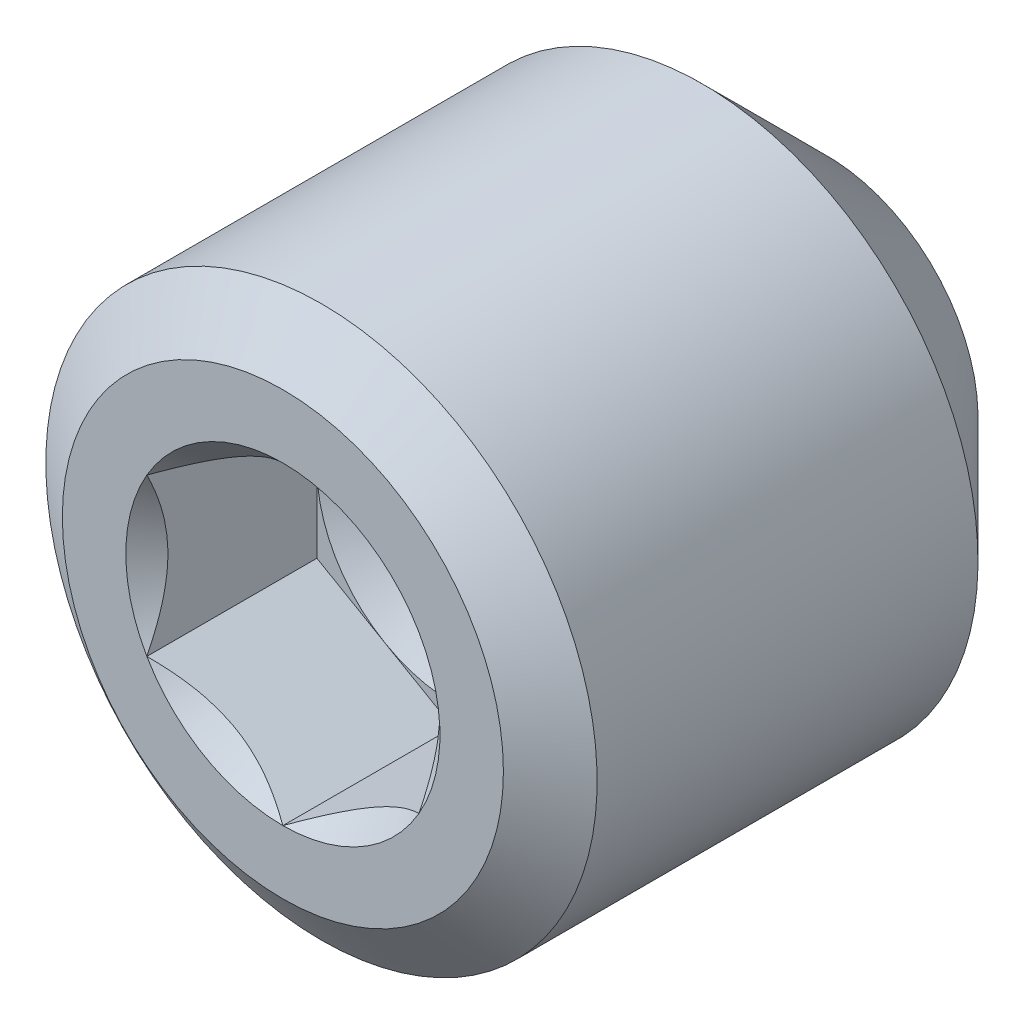
ISO-10303-21;
HEADER;
FILE_DESCRIPTION(('STEP AP214'),'2;1');
FILE_NAME('part.step','',(''),(''),'','','');
FILE_SCHEMA(('AUTOMOTIVE_DESIGN { 1 0 10303 214 1 1 1 1 }'));
ENDSEC;
DATA;
#1=APPLICATION_CONTEXT('core data for automotive mechanical design processes');
#2=APPLICATION_PROTOCOL_DEFINITION('international standard','automotive_design',2000,#1);
#3=PRODUCT_CONTEXT('',#1,'mechanical');
#4=PRODUCT('Part','Part','',(#3));
#5=PRODUCT_RELATED_PRODUCT_CATEGORY('part','',(#4));
#6=PRODUCT_DEFINITION_FORMATION('','',#4);
#7=PRODUCT_DEFINITION_CONTEXT('part definition',#1,'design');
#8=PRODUCT_DEFINITION('design','',#6,#7);
#9=PRODUCT_DEFINITION_SHAPE('','',#8);
#10=(LENGTH_UNIT() NAMED_UNIT(*) SI_UNIT(.MILLI.,.METRE.));
#11=(NAMED_UNIT(*) PLANE_ANGLE_UNIT() SI_UNIT($,.RADIAN.));
#12=(NAMED_UNIT(*) SI_UNIT($,.STERADIAN.) SOLID_ANGLE_UNIT());
#13=UNCERTAINTY_MEASURE_WITH_UNIT(LENGTH_MEASURE(1.E-05),#10,'distance_accuracy_value','');
#14=(GEOMETRIC_REPRESENTATION_CONTEXT(3) GLOBAL_UNCERTAINTY_ASSIGNED_CONTEXT((#13)) GLOBAL_UNIT_ASSIGNED_CONTEXT((#10,
#11,#12)) REPRESENTATION_CONTEXT('',''));
#15=CARTESIAN_POINT('',(0.,0.,0.));
#16=DIRECTION('',(0.,0.,1.));
#17=DIRECTION('',(1.,0.,0.));
#18=AXIS2_PLACEMENT_3D('',#15,#16,#17);
#19=CARTESIAN_POINT('',(0.,0.,0.495727982126937));
#20=DIRECTION('',(0.,0.,1.));
#21=DIRECTION('',(0.,-1.,0.));
#22=AXIS2_PLACEMENT_3D('',#19,#20,#21);
#23=CONICAL_SURFACE('',#22,1.19062499987876,1.04719755103086);
#24=CARTESIAN_POINT('',(2.55795384873636E-10,0.,-0.19167968210354));
#25=VERTEX_POINT('',#24);
#26=VERTEX_LOOP('',#25);
#27=FACE_BOUND('',#26,.T.);
#28=CARTESIAN_POINT('',(0.,0.,0.495727982192574));
#29=DIRECTION('',(0.,0.,1.));
#30=DIRECTION('',(0.,-1.,0.));
#31=AXIS2_PLACEMENT_3D('',#28,#29,#30);
#32=CIRCLE('',#31,1.19062499999245);
#33=CARTESIAN_POINT('',(1.19062499999623,0.,0.495727982183542));
#34=VERTEX_POINT('',#33);
#35=CARTESIAN_POINT('',(0.595312499998112,-1.03111149637757,0.495727982183542));
#36=VERTEX_POINT('',#35);
#37=EDGE_CURVE('E101',#34,#36,#32,.F.);
#38=ORIENTED_EDGE('',*,*,#37,.F.);
#39=CARTESIAN_POINT('',(0.,0.,0.495727982192574));
#40=DIRECTION('',(0.,0.,1.));
#41=DIRECTION('',(0.,-1.,0.));
#42=AXIS2_PLACEMENT_3D('',#39,#40,#41);
#43=CIRCLE('',#42,1.19062499999245);
#44=CARTESIAN_POINT('',(0.59531249999812,1.03111149637759,0.495727982183542));
#45=VERTEX_POINT('',#44);
#46=EDGE_CURVE('E115',#45,#34,#43,.F.);
#47=ORIENTED_EDGE('',*,*,#46,.F.);
#48=CARTESIAN_POINT('',(0.,0.,0.495727982192574));
#49=DIRECTION('',(0.,0.,1.));
#50=DIRECTION('',(0.,-1.,0.));
#51=AXIS2_PLACEMENT_3D('',#48,#49,#50);
#52=CIRCLE('',#51,1.19062499999245);
#53=CARTESIAN_POINT('',(-0.595312499998102,1.0311114963776,0.495727982183538));
#54=VERTEX_POINT('',#53);
#55=EDGE_CURVE('E253',#54,#45,#52,.F.);
#56=ORIENTED_EDGE('',*,*,#55,.F.);
#57=CARTESIAN_POINT('',(0.,0.,0.495727982192574));
#58=DIRECTION('',(0.,0.,1.));
#59=DIRECTION('',(0.,-1.,0.));
#60=AXIS2_PLACEMENT_3D('',#57,#58,#59);
#61=CIRCLE('',#60,1.19062499999245);
#62=CARTESIAN_POINT('',(-1.19062499999622,1.30013777685213E-13,0.495727982183538));
#63=VERTEX_POINT('',#62);
#64=EDGE_CURVE('E152',#63,#54,#61,.F.);
#65=ORIENTED_EDGE('',*,*,#64,.F.);
#66=CARTESIAN_POINT('',(0.,0.,0.495727982192574));
#67=DIRECTION('',(0.,0.,1.));
#68=DIRECTION('',(0.,-1.,0.));
#69=AXIS2_PLACEMENT_3D('',#66,#67,#68);
#70=CIRCLE('',#69,1.19062499999245);
#71=CARTESIAN_POINT('',(-0.595312499998087,-1.03111149637758,0.495727982183542));
#72=VERTEX_POINT('',#71);
#73=EDGE_CURVE('E20',#72,#63,#70,.F.);
#74=ORIENTED_EDGE('',*,*,#73,.F.);
#75=CARTESIAN_POINT('',(0.,0.,0.495727982192574));
#76=DIRECTION('',(0.,0.,1.));
#77=DIRECTION('',(0.,-1.,0.));
#78=AXIS2_PLACEMENT_3D('',#75,#76,#77);
#79=CIRCLE('',#78,1.19062499999245);
#80=EDGE_CURVE('E373',#36,#72,#79,.F.);
#81=ORIENTED_EDGE('',*,*,#80,.F.);
#82=EDGE_LOOP('',(#38,#47,#56,#65,#74,#81));
#83=FACE_BOUND('',#82,.T.);
#84=ADVANCED_FACE('F17',(#27,#83),#23,.F.);
#85=CARTESIAN_POINT('',(-1.190625,2.06222299276171,0.49572798217451));
#86=DIRECTION('',(0.,0.,1.));
#87=DIRECTION('',(0.,-1.,0.));
#88=AXIS2_PLACEMENT_3D('',#85,#86,#87);
#89=PLANE('',#88);
#90=DIRECTION('',(0.,-1.,0.));
#91=VECTOR('',#90,1.);
#92=CARTESIAN_POINT('',(-1.190625,0.687407664253913,0.49572798217451));
#93=LINE('',#92,#91);
#94=CARTESIAN_POINT('',(-1.19062500000001,-0.687407664253882,0.49572798217451));
#95=VERTEX_POINT('',#94);
#96=EDGE_CURVE('E84',#63,#95,#93,.T.);
#97=ORIENTED_EDGE('',*,*,#96,.T.);
#98=DIRECTION('',(0.866025403784438,-0.500000000000001,0.));
#99=VECTOR('',#98,1.);
#100=CARTESIAN_POINT('',(-1.190625,-0.687407664253889,0.49572798217451));
#101=LINE('',#100,#99);
#102=EDGE_CURVE('E168',#95,#72,#101,.T.);
#103=ORIENTED_EDGE('',*,*,#102,.T.);
#104=ORIENTED_EDGE('',*,*,#73,.T.);
#105=EDGE_LOOP('',(#97,#103,#104));
#106=FACE_BOUND('',#105,.T.);
#107=ADVANCED_FACE('F270',(#106),#89,.T.);
#108=CARTESIAN_POINT('',(-1.190625,2.06222299276171,0.49572798217451));
#109=DIRECTION('',(0.,0.,1.));
#110=DIRECTION('',(0.,-1.,0.));
#111=AXIS2_PLACEMENT_3D('',#108,#109,#110);
#112=PLANE('',#111);
#113=DIRECTION('',(0.866025403784438,-0.500000000000001,0.));
#114=VECTOR('',#113,1.);
#115=CARTESIAN_POINT('',(-1.190625,-0.687407664253889,0.495727982174503));
#116=LINE('',#115,#114);
#117=CARTESIAN_POINT('',(0.,-1.37481532850779,0.495727982174507));
#118=VERTEX_POINT('',#117);
#119=EDGE_CURVE('E134',#72,#118,#116,.T.);
#120=ORIENTED_EDGE('',*,*,#119,.T.);
#121=DIRECTION('',(0.866025403784439,0.5,0.));
#122=VECTOR('',#121,1.);
#123=CARTESIAN_POINT('',(0.,-1.37481532850779,0.49572798217451));
#124=LINE('',#123,#122);
#125=EDGE_CURVE('E106',#118,#36,#124,.T.);
#126=ORIENTED_EDGE('',*,*,#125,.T.);
#127=ORIENTED_EDGE('',*,*,#80,.T.);
#128=EDGE_LOOP('',(#120,#126,#127));
#129=FACE_BOUND('',#128,.T.);
#130=ADVANCED_FACE('F268',(#129),#112,.T.);
#131=CARTESIAN_POINT('',(-1.190625,2.06222299276171,0.49572798217451));
#132=DIRECTION('',(0.,0.,1.));
#133=DIRECTION('',(0.,-1.,0.));
#134=AXIS2_PLACEMENT_3D('',#131,#132,#133);
#135=PLANE('',#134);
#136=DIRECTION('',(0.866025403784439,0.5,0.));
#137=VECTOR('',#136,1.);
#138=CARTESIAN_POINT('',(0.,-1.37481532850779,0.49572798217451));
#139=LINE('',#138,#137);
#140=CARTESIAN_POINT('',(1.19062500000001,-0.687407664253884,0.49572798217451));
#141=VERTEX_POINT('',#140);
#142=EDGE_CURVE('E96',#36,#141,#139,.T.);
#143=ORIENTED_EDGE('',*,*,#142,.T.);
#144=DIRECTION('',(0.,1.,0.));
#145=VECTOR('',#144,1.);
#146=CARTESIAN_POINT('',(1.19062500000001,-0.687407664253889,0.49572798217451));
#147=LINE('',#146,#145);
#148=EDGE_CURVE('E99',#141,#34,#147,.T.);
#149=ORIENTED_EDGE('',*,*,#148,.T.);
#150=ORIENTED_EDGE('',*,*,#37,.T.);
#151=EDGE_LOOP('',(#143,#149,#150));
#152=FACE_BOUND('',#151,.T.);
#153=ADVANCED_FACE('F98',(#152),#135,.T.);
#154=CARTESIAN_POINT('',(-1.190625,2.06222299276171,0.49572798217451));
#155=DIRECTION('',(0.,0.,1.));
#156=DIRECTION('',(0.,-1.,0.));
#157=AXIS2_PLACEMENT_3D('',#154,#155,#156);
#158=PLANE('',#157);
#159=DIRECTION('',(0.,1.,0.));
#160=VECTOR('',#159,1.);
#161=CARTESIAN_POINT('',(1.19062500000001,-0.687407664253889,0.495727982174509));
#162=LINE('',#161,#160);
#163=CARTESIAN_POINT('',(1.19062500000003,0.687407664253898,0.495727982174509));
#164=VERTEX_POINT('',#163);
#165=EDGE_CURVE('E114',#34,#164,#162,.T.);
#166=ORIENTED_EDGE('',*,*,#165,.T.);
#167=DIRECTION('',(-0.866025403784438,0.5,0.));
#168=VECTOR('',#167,1.);
#169=CARTESIAN_POINT('',(1.19062500000001,0.687407664253913,0.49572798217451));
#170=LINE('',#169,#168);
#171=EDGE_CURVE('E125',#164,#45,#170,.T.);
#172=ORIENTED_EDGE('',*,*,#171,.T.);
#173=ORIENTED_EDGE('',*,*,#46,.T.);
#174=EDGE_LOOP('',(#166,#172,#173));
#175=FACE_BOUND('',#174,.T.);
#176=ADVANCED_FACE('F261',(#175),#158,.T.);
#177=CARTESIAN_POINT('',(1.19062500000001,-0.687407664253889,0.49572798217451));
#178=DIRECTION('',(1.,0.,0.));
#179=DIRECTION('',(0.,1.,0.));
#180=AXIS2_PLACEMENT_3D('',#177,#178,#179);
#181=PLANE('',#180);
#182=CARTESIAN_POINT('',(1.19062499999567,0.687407664292412,1.98400923211493));
#183=CARTESIAN_POINT('',(1.19062499999845,0.64046328207789,1.96055894231477));
#184=CARTESIAN_POINT('',(1.19062499999959,0.592738991388445,1.9384779182468));
#185=CARTESIAN_POINT('',(1.19062500000044,0.495406225216116,1.89800295513959));
#186=CARTESIAN_POINT('',(1.19062500000013,0.44578762950972,1.87963356850329));
#187=CARTESIAN_POINT('',(1.1906249999999,0.345116375712698,1.84791358583569));
#188=CARTESIAN_POINT('',(1.19062499999999,0.294069215443057,1.83454600462254));
#189=CARTESIAN_POINT('',(1.19062500000004,0.190855854638069,1.81396603547193));
#190=CARTESIAN_POINT('',(1.19062500000002,0.138693632939681,1.80673461351588));
#191=CARTESIAN_POINT('',(1.19062500000001,0.0719511128628457,1.80190389372895));
#192=CARTESIAN_POINT('',(1.19062500000001,0.0575681065477679,1.80112291749238));
#193=CARTESIAN_POINT('',(1.19062500000001,0.0287907386471924,1.80008032792779));
#194=CARTESIAN_POINT('',(1.19062500000001,0.0143963874866042,1.79981843246661));
#195=CARTESIAN_POINT('',(1.19062500000001,-0.0361321030513867,1.79982008619966));
#196=CARTESIAN_POINT('',(1.19062500000001,-0.0722770331511759,1.80147394594884));
#197=CARTESIAN_POINT('',(1.19062500000001,-0.144284982609329,1.80799116289963));
#198=CARTESIAN_POINT('',(1.19062500000001,-0.180147787674807,1.81285675864882));
#199=CARTESIAN_POINT('',(1.19062500000001,-0.287258251714067,1.83196696983393));
#200=CARTESIAN_POINT('',(1.19062500000001,-0.35772529740189,1.85072176782421));
#201=CARTESIAN_POINT('',(1.19062500000001,-0.471552892507442,1.88908925370762));
#202=CARTESIAN_POINT('',(1.19062500000001,-0.515840765958847,1.90614997876308));
#203=CARTESIAN_POINT('',(1.19062500000001,-0.602739573147029,1.94312607455083));
#204=CARTESIAN_POINT('',(1.19062500000001,-0.645362139970547,1.96301390794479));
#205=CARTESIAN_POINT('',(1.19062500000001,-0.687407664293118,1.98400923211292));
#206=B_SPLINE_CURVE_WITH_KNOTS('',3,(#182,#183,#184,#185,#186,#187,#188,#189,#190,#191,#192,
#193,#194,#195,#196,#197,#198,#199,#200,#201,#202,#203,#204,#205),.UNSPECIFIED.,.F.,.F.,(4,2,2,
2,2,2,2,2,2,2,2,4),(0.,0.157535403142992,0.316081041540045,0.474083294698365,0.631593623243647,
0.674799715139207,0.717982317014592,0.826362160391399,0.934817623300469,1.15262451060987,
1.29491478060776,1.43590359051227),.UNSPECIFIED.);
#207=CARTESIAN_POINT('',(1.19062500005789,0.687407664240221,1.98400923213658));
#208=VERTEX_POINT('',#207);
#209=CARTESIAN_POINT('',(1.19062500002894,-0.687407664270611,1.98400923212671));
#210=VERTEX_POINT('',#209);
#211=EDGE_CURVE('E160',#208,#210,#206,.T.);
#212=ORIENTED_EDGE('',*,*,#211,.F.);
#213=DIRECTION('',(0.,0.,1.));
#214=VECTOR('',#213,1.);
#215=CARTESIAN_POINT('',(1.19062500000003,0.687407664253898,0.49572798217451));
#216=LINE('',#215,#214);
#217=EDGE_CURVE('E140',#208,#164,#216,.F.);
#218=ORIENTED_EDGE('',*,*,#217,.T.);
#219=ORIENTED_EDGE('',*,*,#165,.F.);
#220=ORIENTED_EDGE('',*,*,#148,.F.);
#221=DIRECTION('',(0.,0.,1.));
#222=VECTOR('',#221,1.);
#223=CARTESIAN_POINT('',(1.19062500000001,-0.687407664253884,0.49572798217451));
#224=LINE('',#223,#222);
#225=EDGE_CURVE('E105',#141,#210,#224,.T.);
#226=ORIENTED_EDGE('',*,*,#225,.T.);
#227=EDGE_LOOP('',(#212,#218,#219,#220,#226));
#228=FACE_BOUND('',#227,.T.);
#229=ADVANCED_FACE('F111',(#228),#181,.F.);
#230=CARTESIAN_POINT('',(-1.190625,2.06222299276171,0.49572798217451));
#231=DIRECTION('',(0.,0.,1.));
#232=DIRECTION('',(0.,-1.,0.));
#233=AXIS2_PLACEMENT_3D('',#230,#231,#232);
#234=PLANE('',#233);
#235=DIRECTION('',(-0.866025403784438,0.5,0.));
#236=VECTOR('',#235,1.);
#237=CARTESIAN_POINT('',(1.19062500000001,0.687407664253913,0.495727982174503));
#238=LINE('',#237,#236);
#239=CARTESIAN_POINT('',(0.,1.37481532850782,0.495727982174503));
#240=VERTEX_POINT('',#239);
#241=EDGE_CURVE('E137',#45,#240,#238,.T.);
#242=ORIENTED_EDGE('',*,*,#241,.T.);
#243=DIRECTION('',(-0.866025403784439,-0.5,0.));
#244=VECTOR('',#243,1.);
#245=CARTESIAN_POINT('',(0.,1.37481532850781,0.495727982174503));
#246=LINE('',#245,#244);
#247=EDGE_CURVE('E143',#240,#54,#246,.T.);
#248=ORIENTED_EDGE('',*,*,#247,.T.);
#249=ORIENTED_EDGE('',*,*,#55,.T.);
#250=EDGE_LOOP('',(#242,#248,#249));
#251=FACE_BOUND('',#250,.T.);
#252=ADVANCED_FACE('F260',(#251),#234,.T.);
#253=CARTESIAN_POINT('',(-1.190625,2.06222299276171,0.49572798217451));
#254=DIRECTION('',(0.,0.,1.));
#255=DIRECTION('',(0.,-1.,0.));
#256=AXIS2_PLACEMENT_3D('',#253,#254,#255);
#257=PLANE('',#256);
#258=DIRECTION('',(-0.866025403784439,-0.5,0.));
#259=VECTOR('',#258,1.);
#260=CARTESIAN_POINT('',(0.,1.37481532850781,0.495727982174501));
#261=LINE('',#260,#259);
#262=CARTESIAN_POINT('',(-1.190625,0.687407664253916,0.495727982174502));
#263=VERTEX_POINT('',#262);
#264=EDGE_CURVE('E146',#54,#263,#261,.T.);
#265=ORIENTED_EDGE('',*,*,#264,.T.);
#266=DIRECTION('',(0.,-1.,0.));
#267=VECTOR('',#266,1.);
#268=CARTESIAN_POINT('',(-1.190625,0.687407664253913,0.495727982174503));
#269=LINE('',#268,#267);
#270=EDGE_CURVE('E149',#263,#63,#269,.T.);
#271=ORIENTED_EDGE('',*,*,#270,.T.);
#272=ORIENTED_EDGE('',*,*,#64,.T.);
#273=EDGE_LOOP('',(#265,#271,#272));
#274=FACE_BOUND('',#273,.T.);
#275=ADVANCED_FACE('F359',(#274),#257,.T.);
#276=CARTESIAN_POINT('',(-1.190625,0.687407664253913,0.495727982174503));
#277=DIRECTION('',(-1.,0.,0.));
#278=DIRECTION('',(0.,-1.,0.));
#279=AXIS2_PLACEMENT_3D('',#276,#277,#278);
#280=PLANE('',#279);
#281=CARTESIAN_POINT('',(-1.19062499999689,0.687407664295069,1.98400923211557));
#282=CARTESIAN_POINT('',(-1.19062499999888,0.640154592187732,1.96040536744382));
#283=CARTESIAN_POINT('',(-1.1906249999997,0.592111444465279,1.93818802847305));
#284=CARTESIAN_POINT('',(-1.1906250000003,0.494146535985991,1.89750902941694));
#285=CARTESIAN_POINT('',(-1.19062500000008,0.444215463852093,1.87906999571823));
#286=CARTESIAN_POINT('',(-1.19062499999992,0.34353191261821,1.84748380274731));
#287=CARTESIAN_POINT('',(-1.19062499999998,0.292805060660136,1.83425727427473));
#288=CARTESIAN_POINT('',(-1.19062500000002,0.19023488957445,1.81387930355028));
#289=CARTESIAN_POINT('',(-1.190625,0.138394701629495,1.80671265556526));
#290=CARTESIAN_POINT('',(-1.19062499999999,0.0490434171471756,1.80024610055994));
#291=CARTESIAN_POINT('',(-1.190625,0.0116476312291625,1.79928918177737));
#292=CARTESIAN_POINT('',(-1.190625,-0.0630781169061416,1.80090396128143));
#293=CARTESIAN_POINT('',(-1.190625,-0.100408062759505,1.80347643902957));
#294=CARTESIAN_POINT('',(-1.190625,-0.174707550763351,1.81200130363095));
#295=CARTESIAN_POINT('',(-1.190625,-0.211676725216807,1.81795683341918));
#296=CARTESIAN_POINT('',(-1.190625,-0.284997830944034,1.83292705321312));
#297=CARTESIAN_POINT('',(-1.190625,-0.321349490320898,1.84194305589422));
#298=CARTESIAN_POINT('',(-1.190625,-0.414409407701737,1.86868846791361));
#299=CARTESIAN_POINT('',(-1.190625,-0.47053205911329,1.88842523325998));
#300=CARTESIAN_POINT('',(-1.190625,-0.580581647456373,1.93288237138799));
#301=CARTESIAN_POINT('',(-1.190625,-0.634515062273283,1.95758652132262));
#302=CARTESIAN_POINT('',(-1.190625,-0.687407664295433,1.98400923211406));
#303=B_SPLINE_CURVE_WITH_KNOTS('',3,(#281,#282,#283,#284,#285,#286,#287,#288,#289,#290,#291,
#292,#293,#294,#295,#296,#297,#298,#299,#300,#301,#302),.UNSPECIFIED.,.F.,.F.,(4,2,2,2,2,2,2,2,
2,2,4),(0.,0.158570945782174,0.318065397827539,0.475027617267219,0.631594801071171,
0.743660160759135,0.855750273884749,0.967944692071428,1.08018729279008,1.25836291045195,
1.43596581394394),.UNSPECIFIED.);
#304=CARTESIAN_POINT('',(-1.19062500002893,0.687407664270642,1.98400923212671));
#305=VERTEX_POINT('',#304);
#306=CARTESIAN_POINT('',(-1.19062500005789,-0.687407664241365,1.98400923213716));
#307=VERTEX_POINT('',#306);
#308=EDGE_CURVE('E314',#305,#307,#303,.T.);
#309=ORIENTED_EDGE('',*,*,#308,.T.);
#310=DIRECTION('',(0.,0.,1.));
#311=VECTOR('',#310,1.);
#312=CARTESIAN_POINT('',(-1.19062500000001,-0.687407664253882,0.49572798217451));
#313=LINE('',#312,#311);
#314=EDGE_CURVE('E132',#307,#95,#313,.F.);
#315=ORIENTED_EDGE('',*,*,#314,.T.);
#316=ORIENTED_EDGE('',*,*,#96,.F.);
#317=ORIENTED_EDGE('',*,*,#270,.F.);
#318=DIRECTION('',(0.,0.,1.));
#319=VECTOR('',#318,1.);
#320=CARTESIAN_POINT('',(-1.190625,0.687407664253916,0.495727982174503));
#321=LINE('',#320,#319);
#322=EDGE_CURVE('E156',#263,#305,#321,.T.);
#323=ORIENTED_EDGE('',*,*,#322,.T.);
#324=EDGE_LOOP('',(#309,#315,#316,#317,#323));
#325=FACE_BOUND('',#324,.T.);
#326=ADVANCED_FACE('F331',(#325),#280,.F.);
#327=CARTESIAN_POINT('',(-1.190625,-0.687407664253889,0.49572798217451));
#328=DIRECTION('',(-0.500000000000001,-0.866025403784438,0.));
#329=DIRECTION('',(0.866025403784438,-0.500000000000001,0.));
#330=AXIS2_PLACEMENT_3D('',#327,#328,#329);
#331=PLANE('',#330);
#332=CARTESIAN_POINT('',(-1.19062500003409,-0.687407664230629,1.98400923211556));
#333=CARTESIAN_POINT('',(-1.14970263918327,-0.711034200286016,1.96040536744382));
#334=CARTESIAN_POINT('',(-1.10809605277826,-0.73505577414795,1.93818802847304));
#335=CARTESIAN_POINT('',(-1.02325595335608,-0.784038228388114,1.89750902941694));
#336=CARTESIAN_POINT('',(-0.980014376449825,-0.809003764454871,1.87906999571824));
#337=CARTESIAN_POINT('',(-0.892819863337972,-0.859345540071674,1.84748380274731));
#338=CARTESIAN_POINT('',(-0.848889120888296,-0.884708966050761,1.83425727427474));
#339=CARTESIAN_POINT('',(-0.760060747057598,-0.93599405159364,1.81387930355029));
#340=CARTESIAN_POINT('',(-0.7151658273603,-0.961914145566103,1.80671265556527));
#341=CARTESIAN_POINT('',(-0.637785345137837,-1.00658978780726,1.80024610055994));
#342=CARTESIAN_POINT('',(-0.605399644538354,-1.02528768076626,1.79928918177737));
#343=CARTESIAN_POINT('',(-0.540685248336384,-1.06265055483392,1.80090396128143));
#344=CARTESIAN_POINT('',(-0.508356566905473,-1.0813155277606,1.80347643902958));
#345=CARTESIAN_POINT('',(-0.444011322805965,-1.11846527176252,1.81200130363096));
#346=CARTESIAN_POINT('',(-0.411995078572333,-1.13694985898925,1.81795683341919));
#347=CARTESIAN_POINT('',(-0.34849713837899,-1.17361041185286,1.83292705321313));
#348=CARTESIAN_POINT('',(-0.317015677888907,-1.1917862415413,1.84194305589423));
#349=CARTESIAN_POINT('',(-0.23642342536302,-1.23831620023172,1.86868846791362));
#350=CARTESIAN_POINT('',(-0.187819783512877,-1.26637752593749,1.88842523325998));
#351=CARTESIAN_POINT('',(-0.0925140443317495,-1.32140232010903,1.932882371388));
#352=CARTESIAN_POINT('',(-0.0458063369874629,-1.34836902751749,1.95758652132262));
#353=CARTESIAN_POINT('',(3.59780387177723E-11,-1.37481532852856,1.98400923211406));
#354=B_SPLINE_CURVE_WITH_KNOTS('',3,(#332,#333,#334,#335,#336,#337,#338,#339,#340,#341,#342,
#343,#344,#345,#346,#347,#348,#349,#350,#351,#352,#353),.UNSPECIFIED.,.F.,.F.,(4,2,2,2,2,2,2,2,
2,2,4),(0.,0.158570945782172,0.318065397827535,0.475027617267214,0.631594801071164,
0.743660160759128,0.855750273884743,0.967944692071422,1.08018729279007,1.25836291045194,
1.43596581394393),.UNSPECIFIED.);
#355=CARTESIAN_POINT('',(-3.97892995382726E-11,-1.37481532855166,1.98400923213716));
#356=VERTEX_POINT('',#355);
#357=EDGE_CURVE('E319',#307,#356,#354,.T.);
#358=ORIENTED_EDGE('',*,*,#357,.T.);
#359=DIRECTION('',(0.,0.,1.));
#360=VECTOR('',#359,1.);
#361=CARTESIAN_POINT('',(0.,-1.3748153285078,0.49572798217451));
#362=LINE('',#361,#360);
#363=EDGE_CURVE('E122',#356,#118,#362,.F.);
#364=ORIENTED_EDGE('',*,*,#363,.T.);
#365=ORIENTED_EDGE('',*,*,#119,.F.);
#366=ORIENTED_EDGE('',*,*,#102,.F.);
#367=ORIENTED_EDGE('',*,*,#314,.F.);
#368=EDGE_LOOP('',(#358,#364,#365,#366,#367));
#369=FACE_BOUND('',#368,.T.);
#370=ADVANCED_FACE('F352',(#369),#331,.F.);
#371=CARTESIAN_POINT('',(0.,-1.37481532850779,0.49572798217451));
#372=DIRECTION('',(0.5,-0.866025403784439,0.));
#373=DIRECTION('',(0.866025403784439,0.5,0.));
#374=AXIS2_PLACEMENT_3D('',#371,#372,#373);
#375=PLANE('',#374);
#376=CARTESIAN_POINT('',(-3.7187299035962E-11,-1.37481532852568,1.98400923211557));
#377=CARTESIAN_POINT('',(0.0409223608156151,-1.35118879247373,1.96040536744382));
#378=CARTESIAN_POINT('',(0.0825289472214342,-1.32716721861321,1.93818802847305));
#379=CARTESIAN_POINT('',(0.167369046644212,-1.27818476437409,1.89750902941694));
#380=CARTESIAN_POINT('',(0.210610623550247,-1.25321922830695,1.87906999571824));
#381=CARTESIAN_POINT('',(0.297805136661942,-1.20287745268987,1.84748380274731));
#382=CARTESIAN_POINT('',(0.341735879111677,-1.17751402671088,1.83425727427474));
#383=CARTESIAN_POINT('',(0.430564252942422,-1.12622894116808,1.81387930355029));
#384=CARTESIAN_POINT('',(0.475459172639706,-1.10030884719558,1.80671265556527));
#385=CARTESIAN_POINT('',(0.552839654862164,-1.05563320495441,1.80024610055994));
#386=CARTESIAN_POINT('',(0.58522535546165,-1.03693531199541,1.79928918177737));
#387=CARTESIAN_POINT('',(0.649939751663623,-0.999572437927758,1.80090396128143));
#388=CARTESIAN_POINT('',(0.682268433094534,-0.980907465001075,1.80347643902958));
#389=CARTESIAN_POINT('',(0.746613677194042,-0.943757720999152,1.81200130363096));
#390=CARTESIAN_POINT('',(0.778629921427674,-0.925273133772424,1.81795683341919));
#391=CARTESIAN_POINT('',(0.842127861621015,-0.888612580908812,1.83292705321313));
#392=CARTESIAN_POINT('',(0.873609322111098,-0.87043675122038,1.84194305589423));
#393=CARTESIAN_POINT('',(0.954201574636605,-0.82390679253018,1.86868846791349));
#394=CARTESIAN_POINT('',(1.00280521648638,-0.795845466824616,1.88842523325968));
#395=CARTESIAN_POINT('',(1.0981109556668,-0.740820672653482,1.93288237138728));
#396=CARTESIAN_POINT('',(1.14481866301075,-0.713853965245223,1.95758652132166));
#397=CARTESIAN_POINT('',(1.19062500003387,-0.687407664234335,1.98400923211284));
#398=B_SPLINE_CURVE_WITH_KNOTS('',3,(#376,#377,#378,#379,#380,#381,#382,#383,#384,#385,#386,
#387,#388,#389,#390,#391,#392,#393,#394,#395,#396,#397),.UNSPECIFIED.,.F.,.F.,(4,2,2,2,2,2,2,2,
2,2,4),(0.,0.158570945782166,0.318065397827523,0.475027617267209,0.631594801071167,
0.743660160759134,0.855750273884751,0.967944692071429,1.08018729279008,1.25836291045058,
1.43596581394121),.UNSPECIFIED.);
#399=EDGE_CURVE('E120',#356,#210,#398,.T.);
#400=ORIENTED_EDGE('',*,*,#399,.T.);
#401=ORIENTED_EDGE('',*,*,#225,.F.);
#402=ORIENTED_EDGE('',*,*,#142,.F.);
#403=ORIENTED_EDGE('',*,*,#125,.F.);
#404=ORIENTED_EDGE('',*,*,#363,.F.);
#405=EDGE_LOOP('',(#400,#401,#402,#403,#404));
#406=FACE_BOUND('',#405,.T.);
#407=ADVANCED_FACE('F117',(#406),#375,.F.);
#408=CARTESIAN_POINT('',(1.19062500000001,0.687407664253913,0.49572798217451));
#409=DIRECTION('',(0.5,0.866025403784438,0.));
#410=DIRECTION('',(-0.866025403784438,0.5,0.));
#411=AXIS2_PLACEMENT_3D('',#408,#409,#410);
#412=PLANE('',#411);
#413=CARTESIAN_POINT('',(1.19062500003121,0.687407664230863,1.98400923211496));
#414=CARTESIAN_POINT('',(1.14970263918109,0.711034200286776,1.96040536744301));
#415=CARTESIAN_POINT('',(1.10809605277648,0.73505577414887,1.93818802847223));
#416=CARTESIAN_POINT('',(1.0232559533548,0.784038228389021,1.89750902941629));
#417=CARTESIAN_POINT('',(0.980014376448669,0.809003764455604,1.87906999571776));
#418=CARTESIAN_POINT('',(0.892819863337155,0.859345540072137,1.84748380274708));
#419=CARTESIAN_POINT('',(0.848889120887694,0.884708966051127,1.83425727427459));
#420=CARTESIAN_POINT('',(0.760060747057411,0.935994051593786,1.81387930355026));
#421=CARTESIAN_POINT('',(0.715165827360314,0.961914145566125,1.80671265556529));
#422=CARTESIAN_POINT('',(0.637785345138078,1.00658978780714,1.80024610055996));
#423=CARTESIAN_POINT('',(0.605399644538619,1.02528768076614,1.79928918177738));
#424=CARTESIAN_POINT('',(0.540685248336693,1.06265055483377,1.80090396128142));
#425=CARTESIAN_POINT('',(0.508356566905804,1.08131552776044,1.80347643902955));
#426=CARTESIAN_POINT('',(0.444011322806335,1.11846527176234,1.8120013036309));
#427=CARTESIAN_POINT('',(0.41199507857272,1.13694985898906,1.81795683341912));
#428=CARTESIAN_POINT('',(0.348497138379411,1.17361041185265,1.83292705321302));
#429=CARTESIAN_POINT('',(0.317015677889344,1.19178624154107,1.8419430558941));
#430=CARTESIAN_POINT('',(0.236423425363388,1.23831620023153,1.86868846791348));
#431=CARTESIAN_POINT('',(0.187819783513164,1.26637752593735,1.88842523325986));
#432=CARTESIAN_POINT('',(0.0925140443318826,1.32140232010898,1.93288237138793));
#433=CARTESIAN_POINT('',(0.0458063369875248,1.34836902751748,1.9575865213226));
#434=CARTESIAN_POINT('',(-3.59844094553897E-11,1.37481532852859,1.98400923211407));
#435=B_SPLINE_CURVE_WITH_KNOTS('',3,(#413,#414,#415,#416,#417,#418,#419,#420,#421,#422,#423,
#424,#425,#426,#427,#428,#429,#430,#431,#432,#433,#434),.UNSPECIFIED.,.F.,.F.,(4,2,2,2,2,2,2,2,
2,2,4),(0.,0.158570945781483,0.318065397826117,0.475027617265064,0.631594801068299,
0.743660160756186,0.855750273881724,0.967944692068336,1.08018729278692,1.25836291044907,
1.43596581394133),.UNSPECIFIED.);
#436=CARTESIAN_POINT('',(3.9783078504886E-11,1.37481532855168,1.98400923213717));
#437=VERTEX_POINT('',#436);
#438=EDGE_CURVE('E35',#208,#437,#435,.T.);
#439=ORIENTED_EDGE('',*,*,#438,.T.);
#440=DIRECTION('',(0.,0.,1.));
#441=VECTOR('',#440,1.);
#442=CARTESIAN_POINT('',(0.,1.37481532850782,0.495727982174503));
#443=LINE('',#442,#441);
#444=EDGE_CURVE('E312',#437,#240,#443,.F.);
#445=ORIENTED_EDGE('',*,*,#444,.T.);
#446=ORIENTED_EDGE('',*,*,#241,.F.);
#447=ORIENTED_EDGE('',*,*,#171,.F.);
#448=ORIENTED_EDGE('',*,*,#217,.F.);
#449=EDGE_LOOP('',(#439,#445,#446,#447,#448));
#450=FACE_BOUND('',#449,.T.);
#451=ADVANCED_FACE('F351',(#450),#412,.F.);
#452=CARTESIAN_POINT('',(0.,1.37481532850781,0.495727982174503));
#453=DIRECTION('',(-0.5,0.866025403784439,0.));
#454=DIRECTION('',(-0.866025403784439,-0.5,0.));
#455=AXIS2_PLACEMENT_3D('',#452,#453,#454);
#456=PLANE('',#455);
#457=CARTESIAN_POINT('',(3.7170576648238E-11,1.37481532852571,1.98400923211556));
#458=CARTESIAN_POINT('',(-0.0409223608156309,1.35118879247375,1.96040536744381));
#459=CARTESIAN_POINT('',(-0.0825289472214505,1.32716721861323,1.93818802847304));
#460=CARTESIAN_POINT('',(-0.16736904664423,1.2781847643741,1.89750902941694));
#461=CARTESIAN_POINT('',(-0.210610623550268,1.25321922830696,1.87906999571824));
#462=CARTESIAN_POINT('',(-0.297805136661962,1.20287745268989,1.84748380274731));
#463=CARTESIAN_POINT('',(-0.341735879111695,1.1775140267109,1.83425727427474));
#464=CARTESIAN_POINT('',(-0.430564252942435,1.12622894116809,1.81387930355029));
#465=CARTESIAN_POINT('',(-0.475459172639716,1.1003088471956,1.80671265556527));
#466=CARTESIAN_POINT('',(-0.552839654862171,1.05563320495443,1.80024610055995));
#467=CARTESIAN_POINT('',(-0.585225355461656,1.03693531199543,1.79928918177738));
#468=CARTESIAN_POINT('',(-0.649939751663629,0.999572437927779,1.80090396128144));
#469=CARTESIAN_POINT('',(-0.682268433094539,0.980907465001097,1.80347643902958));
#470=CARTESIAN_POINT('',(-0.746613677194047,0.943757720999173,1.81200130363096));
#471=CARTESIAN_POINT('',(-0.77862992142768,0.925273133772445,1.81795683341919));
#472=CARTESIAN_POINT('',(-0.842127861621023,0.888612580908832,1.83292705321314));
#473=CARTESIAN_POINT('',(-0.873609322111106,0.870436751220399,1.84194305589423));
#474=CARTESIAN_POINT('',(-0.954201574636989,0.823906792529983,1.86868846791362));
#475=CARTESIAN_POINT('',(-1.00280521648713,0.795845466824209,1.88842523325999));
#476=CARTESIAN_POINT('',(-1.09811095566825,0.740820672652673,1.932882371388));
#477=CARTESIAN_POINT('',(-1.14481866301253,0.713853965244221,1.95758652132262));
#478=CARTESIAN_POINT('',(-1.19062500003597,0.687407664233149,1.98400923211406));
#479=B_SPLINE_CURVE_WITH_KNOTS('',3,(#457,#458,#459,#460,#461,#462,#463,#464,#465,#466,#467,
#468,#469,#470,#471,#472,#473,#474,#475,#476,#477,#478),.UNSPECIFIED.,.F.,.F.,(4,2,2,2,2,2,2,2,
2,2,4),(0.,0.158570945782171,0.318065397827532,0.47502761726721,0.631594801071159,
0.743660160759124,0.85575027388474,0.967944692071419,1.08018729279007,1.25836291045192,
1.4359658139439),.UNSPECIFIED.);
#480=EDGE_CURVE('E208',#437,#305,#479,.T.);
#481=ORIENTED_EDGE('',*,*,#480,.T.);
#482=ORIENTED_EDGE('',*,*,#322,.F.);
#483=ORIENTED_EDGE('',*,*,#264,.F.);
#484=ORIENTED_EDGE('',*,*,#247,.F.);
#485=ORIENTED_EDGE('',*,*,#444,.F.);
#486=EDGE_LOOP('',(#481,#482,#483,#484,#485));
#487=FACE_BOUND('',#486,.T.);
#488=ADVANCED_FACE('F222',(#487),#456,.F.);
#489=CARTESIAN_POINT('',(0.,0.,1.98400923216013));
#490=DIRECTION('',(0.,0.,1.));
#491=DIRECTION('',(1.,0.,0.));
#492=AXIS2_PLACEMENT_3D('',#489,#490,#491);
#493=CONICAL_SURFACE('',#492,1.37481532857464,0.785398163397448);
#494=ORIENTED_EDGE('',*,*,#308,.F.);
#495=CARTESIAN_POINT('',(0.,0.,1.98400923216013));
#496=DIRECTION('',(0.,0.,1.));
#497=DIRECTION('',(1.,0.,0.));
#498=AXIS2_PLACEMENT_3D('',#495,#496,#497);
#499=CIRCLE('',#498,1.37481532857464);
#500=EDGE_CURVE('E205',#305,#307,#499,.T.);
#501=ORIENTED_EDGE('',*,*,#500,.T.);
#502=EDGE_LOOP('',(#494,#501));
#503=FACE_BOUND('',#502,.T.);
#504=ADVANCED_FACE('F315',(#503),#493,.F.);
#505=CARTESIAN_POINT('',(0.,0.,1.98400923216013));
#506=DIRECTION('',(0.,0.,1.));
#507=DIRECTION('',(1.,0.,0.));
#508=AXIS2_PLACEMENT_3D('',#505,#506,#507);
#509=CONICAL_SURFACE('',#508,1.37481532857464,0.785398163397448);
#510=ORIENTED_EDGE('',*,*,#357,.F.);
#511=CARTESIAN_POINT('',(0.,0.,1.98400923216013));
#512=DIRECTION('',(0.,0.,1.));
#513=DIRECTION('',(1.,0.,0.));
#514=AXIS2_PLACEMENT_3D('',#511,#512,#513);
#515=CIRCLE('',#514,1.37481532857464);
#516=EDGE_CURVE('E202',#307,#356,#515,.T.);
#517=ORIENTED_EDGE('',*,*,#516,.T.);
#518=EDGE_LOOP('',(#510,#517));
#519=FACE_BOUND('',#518,.T.);
#520=ADVANCED_FACE('F335',(#519),#509,.F.);
#521=CARTESIAN_POINT('',(0.,0.,1.98400923216013));
#522=DIRECTION('',(0.,0.,1.));
#523=DIRECTION('',(1.,0.,0.));
#524=AXIS2_PLACEMENT_3D('',#521,#522,#523);
#525=CONICAL_SURFACE('',#524,1.37481532857464,0.785398163397448);
#526=ORIENTED_EDGE('',*,*,#399,.F.);
#527=CARTESIAN_POINT('',(0.,0.,1.98400923216013));
#528=DIRECTION('',(0.,0.,1.));
#529=DIRECTION('',(1.,0.,0.));
#530=AXIS2_PLACEMENT_3D('',#527,#528,#529);
#531=CIRCLE('',#530,1.37481532857464);
#532=EDGE_CURVE('E200',#356,#210,#531,.T.);
#533=ORIENTED_EDGE('',*,*,#532,.T.);
#534=EDGE_LOOP('',(#526,#533));
#535=FACE_BOUND('',#534,.T.);
#536=ADVANCED_FACE('F241',(#535),#525,.F.);
#537=CARTESIAN_POINT('',(0.,0.,1.98400923216013));
#538=DIRECTION('',(0.,0.,1.));
#539=DIRECTION('',(1.,0.,0.));
#540=AXIS2_PLACEMENT_3D('',#537,#538,#539);
#541=CONICAL_SURFACE('',#540,1.37481532857464,0.785398163550834);
#542=CARTESIAN_POINT('',(0.,0.,1.98400923216013));
#543=DIRECTION('',(0.,0.,1.));
#544=DIRECTION('',(1.,0.,0.));
#545=AXIS2_PLACEMENT_3D('',#542,#543,#544);
#546=CIRCLE('',#545,1.37481532857464);
#547=EDGE_CURVE('E197',#210,#208,#546,.T.);
#548=ORIENTED_EDGE('',*,*,#547,.T.);
#549=ORIENTED_EDGE('',*,*,#211,.T.);
#550=EDGE_LOOP('',(#548,#549));
#551=FACE_BOUND('',#550,.T.);
#552=ADVANCED_FACE('F236',(#551),#541,.F.);
#553=CARTESIAN_POINT('',(0.,0.,1.98400923216013));
#554=DIRECTION('',(0.,0.,1.));
#555=DIRECTION('',(1.,0.,0.));
#556=AXIS2_PLACEMENT_3D('',#553,#554,#555);
#557=CONICAL_SURFACE('',#556,1.37481532857464,0.785398163397448);
#558=ORIENTED_EDGE('',*,*,#438,.F.);
#559=CARTESIAN_POINT('',(0.,0.,1.98400923216013));
#560=DIRECTION('',(0.,0.,1.));
#561=DIRECTION('',(1.,0.,0.));
#562=AXIS2_PLACEMENT_3D('',#559,#560,#561);
#563=CIRCLE('',#562,1.37481532857464);
#564=EDGE_CURVE('E194',#208,#437,#563,.T.);
#565=ORIENTED_EDGE('',*,*,#564,.T.);
#566=EDGE_LOOP('',(#558,#565));
#567=FACE_BOUND('',#566,.T.);
#568=ADVANCED_FACE('F230',(#567),#557,.F.);
#569=CARTESIAN_POINT('',(0.,0.,1.98400923216013));
#570=DIRECTION('',(0.,0.,1.));
#571=DIRECTION('',(1.,0.,0.));
#572=AXIS2_PLACEMENT_3D('',#569,#570,#571);
#573=CONICAL_SURFACE('',#572,1.37481532857464,0.785398163397448);
#574=ORIENTED_EDGE('',*,*,#480,.F.);
#575=CARTESIAN_POINT('',(0.,0.,1.98400923216013));
#576=DIRECTION('',(0.,0.,1.));
#577=DIRECTION('',(1.,0.,0.));
#578=AXIS2_PLACEMENT_3D('',#575,#576,#577);
#579=CIRCLE('',#578,1.37481532857464);
#580=EDGE_CURVE('E191',#437,#305,#579,.T.);
#581=ORIENTED_EDGE('',*,*,#580,.T.);
#582=EDGE_LOOP('',(#574,#581));
#583=FACE_BOUND('',#582,.T.);
#584=ADVANCED_FACE('F225',(#583),#573,.F.);
#585=CARTESIAN_POINT('',(0.,1.32223931889029,-2.77849076782551));
#586=DIRECTION('',(0.,0.,1.));
#587=DIRECTION('',(0.,-1.,0.));
#588=AXIS2_PLACEMENT_3D('',#585,#586,#587);
#589=PLANE('',#588);
#590=CARTESIAN_POINT('',(0.,0.,-2.77849076780968));
#591=DIRECTION('',(0.,0.,1.));
#592=DIRECTION('',(0.,-1.,0.));
#593=AXIS2_PLACEMENT_3D('',#590,#591,#592);
#594=CIRCLE('',#593,1.3222393188812);
#595=CARTESIAN_POINT('',(0.,-1.3222393188812,-2.77849076780967));
#596=VERTEX_POINT('',#595);
#597=EDGE_CURVE('E188',#596,#596,#594,.T.);
#598=ORIENTED_EDGE('',*,*,#597,.F.);
#599=EDGE_LOOP('',(#598));
#600=FACE_BOUND('',#599,.T.);
#601=ADVANCED_FACE('F229',(#600),#589,.F.);
#602=CARTESIAN_POINT('',(0.,0.,1.98400923217451));
#603=DIRECTION('',(0.,0.,-1.));
#604=DIRECTION('',(0.,1.,0.));
#605=AXIS2_PLACEMENT_3D('',#602,#603,#604);
#606=PLANE('',#605);
#607=CARTESIAN_POINT('',(0.,0.,1.98400923213738));
#608=DIRECTION('',(0.,0.,-1.));
#609=DIRECTION('',(0.,1.,0.));
#610=AXIS2_PLACEMENT_3D('',#607,#608,#609);
#611=CIRCLE('',#610,1.93040000004882);
#612=CARTESIAN_POINT('',(0.,1.93040000004885,1.98400923213737));
#613=VERTEX_POINT('',#612);
#614=EDGE_CURVE('E185',#613,#613,#611,.T.);
#615=ORIENTED_EDGE('',*,*,#614,.F.);
#616=EDGE_LOOP('',(#615));
#617=FACE_BOUND('',#616,.T.);
#618=ORIENTED_EDGE('',*,*,#564,.F.);
#619=ORIENTED_EDGE('',*,*,#547,.F.);
#620=ORIENTED_EDGE('',*,*,#532,.F.);
#621=ORIENTED_EDGE('',*,*,#516,.F.);
#622=ORIENTED_EDGE('',*,*,#500,.F.);
#623=ORIENTED_EDGE('',*,*,#580,.F.);
#624=EDGE_LOOP('',(#618,#619,#620,#621,#622,#623));
#625=FACE_BOUND('',#624,.T.);
#626=ADVANCED_FACE('F292',(#617,#625),#606,.F.);
#627=CARTESIAN_POINT('',(0.,0.,-1.68773008670088));
#628=DIRECTION('',(0.,0.,1.));
#629=DIRECTION('',(0.,-1.,0.));
#630=AXIS2_PLACEMENT_3D('',#627,#628,#629);
#631=CONICAL_SURFACE('',#630,2.41299999993317,0.785398163371396);
#632=CARTESIAN_POINT('',(0.,0.,-1.68773008671579));
#633=DIRECTION('',(0.,0.,1.));
#634=DIRECTION('',(0.,-1.,0.));
#635=AXIS2_PLACEMENT_3D('',#632,#633,#634);
#636=CIRCLE('',#635,2.41299999999999);
#637=CARTESIAN_POINT('',(0.,-2.41299999999999,-1.68773008671578));
#638=VERTEX_POINT('',#637);
#639=EDGE_CURVE('E26',#638,#638,#636,.T.);
#640=ORIENTED_EDGE('',*,*,#639,.F.);
#641=EDGE_LOOP('',(#640));
#642=FACE_BOUND('',#641,.T.);
#643=ORIENTED_EDGE('',*,*,#597,.T.);
#644=EDGE_LOOP('',(#643));
#645=FACE_BOUND('',#644,.T.);
#646=ADVANCED_FACE('F286',(#642,#645),#631,.T.);
#647=CARTESIAN_POINT('',(0.,0.,1.64608907431331));
#648=DIRECTION('',(0.,0.,-1.));
#649=DIRECTION('',(0.,1.,0.));
#650=AXIS2_PLACEMENT_3D('',#647,#648,#649);
#651=CONICAL_SURFACE('',#650,2.41299999993314,0.959931088645446);
#652=CARTESIAN_POINT('',(0.,0.,1.64608907423451));
#653=DIRECTION('',(0.,0.,1.));
#654=DIRECTION('',(0.,-1.,0.));
#655=AXIS2_PLACEMENT_3D('',#652,#653,#654);
#656=CIRCLE('',#655,2.41299999999999);
#657=CARTESIAN_POINT('',(0.,-2.41299999999997,1.64608907423452));
#658=VERTEX_POINT('',#657);
#659=EDGE_CURVE('E11',#658,#658,#656,.F.);
#660=ORIENTED_EDGE('',*,*,#659,.F.);
#661=EDGE_LOOP('',(#660));
#662=FACE_BOUND('',#661,.T.);
#663=ORIENTED_EDGE('',*,*,#614,.T.);
#664=EDGE_LOOP('',(#663));
#665=FACE_BOUND('',#664,.T.);
#666=ADVANCED_FACE('F280',(#662,#665),#651,.T.);
#667=CARTESIAN_POINT('',(0.,0.,-1.9840092321745));
#668=DIRECTION('',(0.,0.,1.));
#669=DIRECTION('',(0.,-1.,0.));
#670=AXIS2_PLACEMENT_3D('',#667,#668,#669);
#671=CYLINDRICAL_SURFACE('',#670,2.41299999999999);
#672=ORIENTED_EDGE('',*,*,#659,.T.);
#673=EDGE_LOOP('',(#672));
#674=FACE_BOUND('',#673,.T.);
#675=ORIENTED_EDGE('',*,*,#639,.T.);
#676=EDGE_LOOP('',(#675));
#677=FACE_BOUND('',#676,.T.);
#678=ADVANCED_FACE('F278',(#674,#677),#671,.T.);
#679=CLOSED_SHELL('',(#84,#107,#130,#153,#176,#229,#252,#275,#326,#370,#407,#451,#488,#504,#520,
#536,#552,#568,#584,#601,#626,#646,#666,#678));
#680=MANIFOLD_SOLID_BREP('B1',#679);
#681=ADVANCED_BREP_SHAPE_REPRESENTATION('',(#18,#680),#14);
#682=SHAPE_DEFINITION_REPRESENTATION(#9,#681);
ENDSEC;
END-ISO-10303-21;
